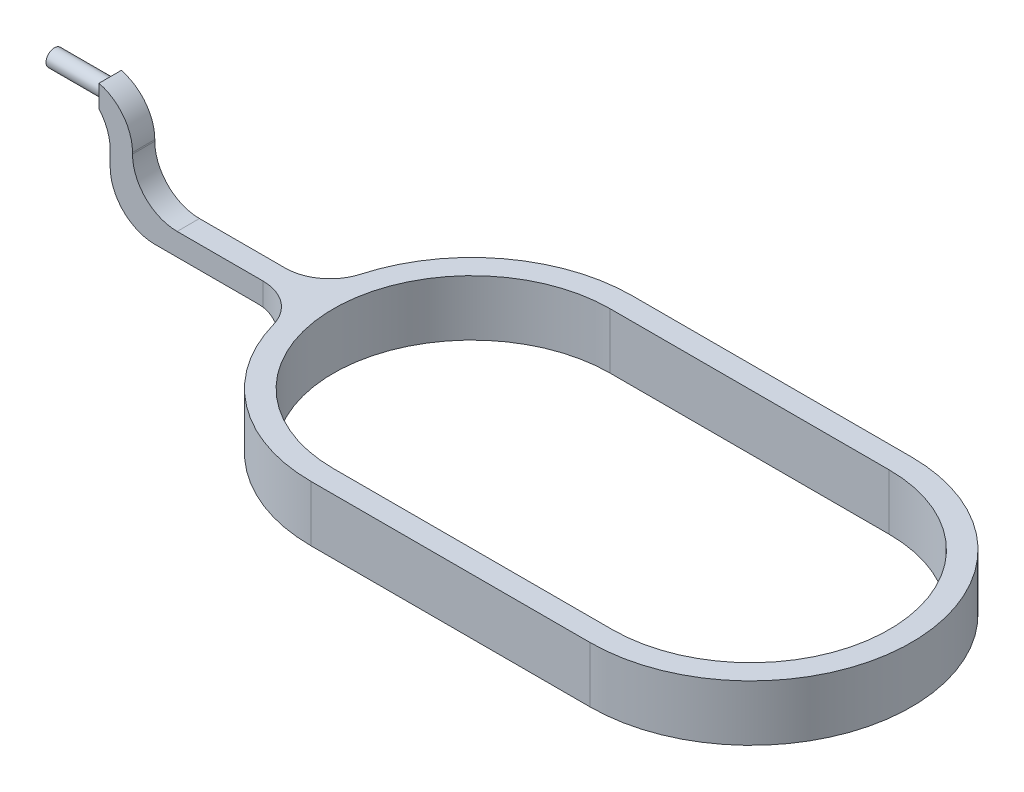
ISO-10303-21;
HEADER;
FILE_DESCRIPTION(('STEP AP214'),'2;1');
FILE_NAME('part.step','',(''),(''),'','','');
FILE_SCHEMA(('AUTOMOTIVE_DESIGN { 1 0 10303 214 1 1 1 1 }'));
ENDSEC;
DATA;
#1=APPLICATION_CONTEXT('core data for automotive mechanical design processes');
#2=APPLICATION_PROTOCOL_DEFINITION('international standard','automotive_design',2000,#1);
#3=PRODUCT_CONTEXT('',#1,'mechanical');
#4=PRODUCT('Part','Part','',(#3));
#5=PRODUCT_RELATED_PRODUCT_CATEGORY('part','',(#4));
#6=PRODUCT_DEFINITION_FORMATION('','',#4);
#7=PRODUCT_DEFINITION_CONTEXT('part definition',#1,'design');
#8=PRODUCT_DEFINITION('design','',#6,#7);
#9=PRODUCT_DEFINITION_SHAPE('','',#8);
#10=(LENGTH_UNIT() NAMED_UNIT(*) SI_UNIT(.MILLI.,.METRE.));
#11=(NAMED_UNIT(*) PLANE_ANGLE_UNIT() SI_UNIT($,.RADIAN.));
#12=(NAMED_UNIT(*) SI_UNIT($,.STERADIAN.) SOLID_ANGLE_UNIT());
#13=UNCERTAINTY_MEASURE_WITH_UNIT(LENGTH_MEASURE(1.E-05),#10,'distance_accuracy_value','');
#14=(GEOMETRIC_REPRESENTATION_CONTEXT(3) GLOBAL_UNCERTAINTY_ASSIGNED_CONTEXT((#13)) GLOBAL_UNIT_ASSIGNED_CONTEXT((#10,
#11,#12)) REPRESENTATION_CONTEXT('',''));
#15=CARTESIAN_POINT('',(0.,0.,0.));
#16=DIRECTION('',(0.,0.,1.));
#17=DIRECTION('',(1.,0.,0.));
#18=AXIS2_PLACEMENT_3D('',#15,#16,#17);
#19=CARTESIAN_POINT('',(0.,5.,0.));
#20=DIRECTION('',(0.,-1.,0.));
#21=DIRECTION('',(0.,0.,-1.));
#22=AXIS2_PLACEMENT_3D('',#19,#20,#21);
#23=CYLINDRICAL_SURFACE('',#22,14.4);
#24=CARTESIAN_POINT('',(0.,0.,0.));
#25=DIRECTION('',(0.,1.,0.));
#26=DIRECTION('',(0.,0.,1.));
#27=AXIS2_PLACEMENT_3D('',#24,#25,#26);
#28=CIRCLE('',#27,14.4);
#29=CARTESIAN_POINT('',(0.,0.,-14.4));
#30=VERTEX_POINT('',#29);
#31=CARTESIAN_POINT('',(-13.8581416769075,0.,-3.91304347826087));
#32=VERTEX_POINT('',#31);
#33=EDGE_CURVE('E293',#30,#32,#28,.T.);
#34=ORIENTED_EDGE('',*,*,#33,.T.);
#35=DIRECTION('',(0.,-1.,0.));
#36=VECTOR('',#35,1.);
#37=CARTESIAN_POINT('',(-13.8581416769075,5.,-3.91304347826087));
#38=LINE('',#37,#36);
#39=CARTESIAN_POINT('',(-13.8581416769075,5.,-3.91304347826087));
#40=VERTEX_POINT('',#39);
#41=EDGE_CURVE('E207',#32,#40,#38,.F.);
#42=ORIENTED_EDGE('',*,*,#41,.T.);
#43=CARTESIAN_POINT('',(0.,5.,0.));
#44=DIRECTION('',(0.,1.,0.));
#45=DIRECTION('',(0.,0.,1.));
#46=AXIS2_PLACEMENT_3D('',#43,#44,#45);
#47=CIRCLE('',#46,14.4);
#48=CARTESIAN_POINT('',(0.,5.,-14.4));
#49=VERTEX_POINT('',#48);
#50=EDGE_CURVE('E278',#49,#40,#47,.T.);
#51=ORIENTED_EDGE('',*,*,#50,.F.);
#52=DIRECTION('',(0.,-1.,0.));
#53=VECTOR('',#52,1.);
#54=CARTESIAN_POINT('',(0.,5.,-14.4));
#55=LINE('',#54,#53);
#56=EDGE_CURVE('E292',#49,#30,#55,.T.);
#57=ORIENTED_EDGE('',*,*,#56,.T.);
#58=EDGE_LOOP('',(#34,#42,#51,#57));
#59=FACE_BOUND('',#58,.T.);
#60=ADVANCED_FACE('F41',(#59),#23,.T.);
#61=CARTESIAN_POINT('',(-13.8581416769075,5.,3.91304347826087));
#62=VERTEX_POINT('',#61);
#63=CARTESIAN_POINT('',(0.,5.,14.4));
#64=VERTEX_POINT('',#63);
#65=EDGE_CURVE('E283',#62,#64,#47,.T.);
#66=ORIENTED_EDGE('',*,*,#65,.F.);
#67=DIRECTION('',(0.,-1.,0.));
#68=VECTOR('',#67,1.);
#69=CARTESIAN_POINT('',(-13.8581416769075,5.,3.91304347826087));
#70=LINE('',#69,#68);
#71=CARTESIAN_POINT('',(-13.8581416769075,0.,3.91304347826087));
#72=VERTEX_POINT('',#71);
#73=EDGE_CURVE('E330',#62,#72,#70,.T.);
#74=ORIENTED_EDGE('',*,*,#73,.T.);
#75=CARTESIAN_POINT('',(0.,0.,14.4));
#76=VERTEX_POINT('',#75);
#77=EDGE_CURVE('E277',#72,#76,#28,.T.);
#78=ORIENTED_EDGE('',*,*,#77,.T.);
#79=DIRECTION('',(0.,-1.,0.));
#80=VECTOR('',#79,1.);
#81=CARTESIAN_POINT('',(0.,5.,14.4));
#82=LINE('',#81,#80);
#83=EDGE_CURVE('E318',#64,#76,#82,.T.);
#84=ORIENTED_EDGE('',*,*,#83,.F.);
#85=EDGE_LOOP('',(#66,#74,#78,#84));
#86=FACE_BOUND('',#85,.T.);
#87=ADVANCED_FACE('F432',(#86),#23,.T.);
#88=CARTESIAN_POINT('',(0.,5.,0.));
#89=DIRECTION('',(0.,1.,0.));
#90=DIRECTION('',(0.,0.,1.));
#91=AXIS2_PLACEMENT_3D('',#88,#89,#90);
#92=PLANE('',#91);
#93=DIRECTION('',(1.,0.,0.));
#94=VECTOR('',#93,1.);
#95=CARTESIAN_POINT('',(0.,5.,12.4));
#96=LINE('',#95,#94);
#97=CARTESIAN_POINT('',(0.,5.,12.4));
#98=VERTEX_POINT('',#97);
#99=CARTESIAN_POINT('',(25.,5.,12.4));
#100=VERTEX_POINT('',#99);
#101=EDGE_CURVE('E238',#98,#100,#96,.T.);
#102=ORIENTED_EDGE('',*,*,#101,.F.);
#103=CARTESIAN_POINT('',(0.,5.,0.));
#104=DIRECTION('',(0.,1.,0.));
#105=DIRECTION('',(0.,0.,1.));
#106=AXIS2_PLACEMENT_3D('',#103,#104,#105);
#107=CIRCLE('',#106,12.4);
#108=CARTESIAN_POINT('',(0.,5.,-12.4));
#109=VERTEX_POINT('',#108);
#110=EDGE_CURVE('E235',#109,#98,#107,.T.);
#111=ORIENTED_EDGE('',*,*,#110,.F.);
#112=DIRECTION('',(-1.,0.,0.));
#113=VECTOR('',#112,1.);
#114=CARTESIAN_POINT('',(0.,5.,-12.4));
#115=LINE('',#114,#113);
#116=CARTESIAN_POINT('',(25.,5.,-12.4));
#117=VERTEX_POINT('',#116);
#118=EDGE_CURVE('E246',#117,#109,#115,.T.);
#119=ORIENTED_EDGE('',*,*,#118,.F.);
#120=CARTESIAN_POINT('',(25.,5.,0.));
#121=DIRECTION('',(0.,1.,0.));
#122=DIRECTION('',(0.,0.,1.));
#123=AXIS2_PLACEMENT_3D('',#120,#121,#122);
#124=CIRCLE('',#123,12.4);
#125=EDGE_CURVE('E242',#100,#117,#124,.T.);
#126=ORIENTED_EDGE('',*,*,#125,.F.);
#127=EDGE_LOOP('',(#102,#111,#119,#126));
#128=FACE_BOUND('',#127,.T.);
#129=DIRECTION('',(-1.,0.,0.));
#130=VECTOR('',#129,1.);
#131=CARTESIAN_POINT('',(0.,5.,-1.));
#132=LINE('',#131,#130);
#133=CARTESIAN_POINT('',(-17.7076254760484,5.,-1.));
#134=VERTEX_POINT('',#133);
#135=CARTESIAN_POINT('',(-25.4,5.,-1.));
#136=VERTEX_POINT('',#135);
#137=EDGE_CURVE('E232',#134,#136,#132,.T.);
#138=ORIENTED_EDGE('',*,*,#137,.T.);
#139=DIRECTION('',(0.,0.,1.));
#140=VECTOR('',#139,1.);
#141=CARTESIAN_POINT('',(-25.4,5.,0.));
#142=LINE('',#141,#140);
#143=CARTESIAN_POINT('',(-25.4,5.,1.));
#144=VERTEX_POINT('',#143);
#145=EDGE_CURVE('E352',#136,#144,#142,.T.);
#146=ORIENTED_EDGE('',*,*,#145,.T.);
#147=DIRECTION('',(-1.,0.,0.));
#148=VECTOR('',#147,1.);
#149=CARTESIAN_POINT('',(0.,5.,1.));
#150=LINE('',#149,#148);
#151=CARTESIAN_POINT('',(-17.7076254760484,5.,1.));
#152=VERTEX_POINT('',#151);
#153=EDGE_CURVE('E527',#152,#144,#150,.T.);
#154=ORIENTED_EDGE('',*,*,#153,.F.);
#155=CARTESIAN_POINT('',(-17.7076254760484,5.,5.));
#156=DIRECTION('',(0.,1.,0.));
#157=DIRECTION('',(0.,0.,1.));
#158=AXIS2_PLACEMENT_3D('',#155,#156,#157);
#159=CIRCLE('',#158,4.);
#160=EDGE_CURVE('E365',#152,#62,#159,.F.);
#161=ORIENTED_EDGE('',*,*,#160,.T.);
#162=ORIENTED_EDGE('',*,*,#65,.T.);
#163=DIRECTION('',(1.,0.,0.));
#164=VECTOR('',#163,1.);
#165=CARTESIAN_POINT('',(0.,5.,14.4));
#166=LINE('',#165,#164);
#167=CARTESIAN_POINT('',(25.,5.,14.4));
#168=VERTEX_POINT('',#167);
#169=EDGE_CURVE('E282',#64,#168,#166,.T.);
#170=ORIENTED_EDGE('',*,*,#169,.T.);
#171=CARTESIAN_POINT('',(25.,5.,0.));
#172=DIRECTION('',(0.,1.,0.));
#173=DIRECTION('',(0.,0.,1.));
#174=AXIS2_PLACEMENT_3D('',#171,#172,#173);
#175=CIRCLE('',#174,14.4);
#176=CARTESIAN_POINT('',(25.,5.,-14.4));
#177=VERTEX_POINT('',#176);
#178=EDGE_CURVE('E286',#168,#177,#175,.T.);
#179=ORIENTED_EDGE('',*,*,#178,.T.);
#180=DIRECTION('',(-1.,0.,0.));
#181=VECTOR('',#180,1.);
#182=CARTESIAN_POINT('',(0.,5.,-14.4));
#183=LINE('',#182,#181);
#184=EDGE_CURVE('E289',#177,#49,#183,.T.);
#185=ORIENTED_EDGE('',*,*,#184,.T.);
#186=ORIENTED_EDGE('',*,*,#50,.T.);
#187=CARTESIAN_POINT('',(-17.7076254760484,5.,-5.));
#188=DIRECTION('',(0.,1.,0.));
#189=DIRECTION('',(0.,0.,1.));
#190=AXIS2_PLACEMENT_3D('',#187,#188,#189);
#191=CIRCLE('',#190,4.);
#192=EDGE_CURVE('E362',#40,#134,#191,.F.);
#193=ORIENTED_EDGE('',*,*,#192,.T.);
#194=EDGE_LOOP('',(#138,#146,#154,#161,#162,#170,#179,#185,#186,#193));
#195=FACE_BOUND('',#194,.T.);
#196=ADVANCED_FACE('F428',(#128,#195),#92,.T.);
#197=CARTESIAN_POINT('',(0.,0.,0.));
#198=DIRECTION('',(0.,1.,0.));
#199=DIRECTION('',(0.,0.,1.));
#200=AXIS2_PLACEMENT_3D('',#197,#198,#199);
#201=PLANE('',#200);
#202=ORIENTED_EDGE('',*,*,#33,.F.);
#203=DIRECTION('',(-1.,0.,0.));
#204=VECTOR('',#203,1.);
#205=CARTESIAN_POINT('',(0.,0.,-14.4));
#206=LINE('',#205,#204);
#207=CARTESIAN_POINT('',(25.,0.,-14.4));
#208=VERTEX_POINT('',#207);
#209=EDGE_CURVE('E304',#208,#30,#206,.T.);
#210=ORIENTED_EDGE('',*,*,#209,.F.);
#211=CARTESIAN_POINT('',(25.,0.,0.));
#212=DIRECTION('',(0.,1.,0.));
#213=DIRECTION('',(0.,0.,1.));
#214=AXIS2_PLACEMENT_3D('',#211,#212,#213);
#215=CIRCLE('',#214,14.4);
#216=CARTESIAN_POINT('',(25.,0.,14.4));
#217=VERTEX_POINT('',#216);
#218=EDGE_CURVE('E301',#217,#208,#215,.T.);
#219=ORIENTED_EDGE('',*,*,#218,.F.);
#220=DIRECTION('',(1.,0.,0.));
#221=VECTOR('',#220,1.);
#222=CARTESIAN_POINT('',(0.,0.,14.4));
#223=LINE('',#222,#221);
#224=EDGE_CURVE('E297',#76,#217,#223,.T.);
#225=ORIENTED_EDGE('',*,*,#224,.F.);
#226=ORIENTED_EDGE('',*,*,#77,.F.);
#227=EDGE_CURVE('E298',#32,#72,#28,.T.);
#228=ORIENTED_EDGE('',*,*,#227,.F.);
#229=EDGE_LOOP('',(#202,#210,#219,#225,#226,#228));
#230=FACE_BOUND('',#229,.T.);
#231=CARTESIAN_POINT('',(0.,0.,0.));
#232=DIRECTION('',(0.,1.,0.));
#233=DIRECTION('',(0.,0.,1.));
#234=AXIS2_PLACEMENT_3D('',#231,#232,#233);
#235=CIRCLE('',#234,12.4);
#236=CARTESIAN_POINT('',(0.,0.,-12.4));
#237=VERTEX_POINT('',#236);
#238=CARTESIAN_POINT('',(0.,0.,12.4));
#239=VERTEX_POINT('',#238);
#240=EDGE_CURVE('E229',#237,#239,#235,.T.);
#241=ORIENTED_EDGE('',*,*,#240,.T.);
#242=DIRECTION('',(1.,0.,0.));
#243=VECTOR('',#242,1.);
#244=CARTESIAN_POINT('',(0.,0.,12.4));
#245=LINE('',#244,#243);
#246=CARTESIAN_POINT('',(25.,0.,12.4));
#247=VERTEX_POINT('',#246);
#248=EDGE_CURVE('E253',#239,#247,#245,.T.);
#249=ORIENTED_EDGE('',*,*,#248,.T.);
#250=CARTESIAN_POINT('',(25.,0.,0.));
#251=DIRECTION('',(0.,1.,0.));
#252=DIRECTION('',(0.,0.,1.));
#253=AXIS2_PLACEMENT_3D('',#250,#251,#252);
#254=CIRCLE('',#253,12.4);
#255=CARTESIAN_POINT('',(25.,0.,-12.4));
#256=VERTEX_POINT('',#255);
#257=EDGE_CURVE('E257',#247,#256,#254,.T.);
#258=ORIENTED_EDGE('',*,*,#257,.T.);
#259=DIRECTION('',(-1.,0.,0.));
#260=VECTOR('',#259,1.);
#261=CARTESIAN_POINT('',(0.,0.,-12.4));
#262=LINE('',#261,#260);
#263=EDGE_CURVE('E239',#256,#237,#262,.T.);
#264=ORIENTED_EDGE('',*,*,#263,.T.);
#265=EDGE_LOOP('',(#241,#249,#258,#264));
#266=FACE_BOUND('',#265,.T.);
#267=ADVANCED_FACE('F431',(#230,#266),#201,.F.);
#268=CARTESIAN_POINT('',(0.,5.,14.4));
#269=DIRECTION('',(0.,0.,-1.));
#270=DIRECTION('',(-1.,0.,0.));
#271=AXIS2_PLACEMENT_3D('',#268,#269,#270);
#272=PLANE('',#271);
#273=ORIENTED_EDGE('',*,*,#224,.T.);
#274=DIRECTION('',(0.,-1.,0.));
#275=VECTOR('',#274,1.);
#276=CARTESIAN_POINT('',(25.,5.,14.4));
#277=LINE('',#276,#275);
#278=EDGE_CURVE('E314',#168,#217,#277,.T.);
#279=ORIENTED_EDGE('',*,*,#278,.F.);
#280=ORIENTED_EDGE('',*,*,#169,.F.);
#281=ORIENTED_EDGE('',*,*,#83,.T.);
#282=EDGE_LOOP('',(#273,#279,#280,#281));
#283=FACE_BOUND('',#282,.T.);
#284=ADVANCED_FACE('F436',(#283),#272,.F.);
#285=CARTESIAN_POINT('',(25.,5.,0.));
#286=DIRECTION('',(0.,-1.,0.));
#287=DIRECTION('',(0.,0.,-1.));
#288=AXIS2_PLACEMENT_3D('',#285,#286,#287);
#289=CYLINDRICAL_SURFACE('',#288,14.4);
#290=ORIENTED_EDGE('',*,*,#218,.T.);
#291=DIRECTION('',(0.,-1.,0.));
#292=VECTOR('',#291,1.);
#293=CARTESIAN_POINT('',(25.,5.,-14.4));
#294=LINE('',#293,#292);
#295=EDGE_CURVE('E310',#177,#208,#294,.T.);
#296=ORIENTED_EDGE('',*,*,#295,.F.);
#297=ORIENTED_EDGE('',*,*,#178,.F.);
#298=ORIENTED_EDGE('',*,*,#278,.T.);
#299=EDGE_LOOP('',(#290,#296,#297,#298));
#300=FACE_BOUND('',#299,.T.);
#301=ADVANCED_FACE('F440',(#300),#289,.T.);
#302=CARTESIAN_POINT('',(0.,5.,-14.4));
#303=DIRECTION('',(0.,0.,1.));
#304=DIRECTION('',(1.,0.,0.));
#305=AXIS2_PLACEMENT_3D('',#302,#303,#304);
#306=PLANE('',#305);
#307=ORIENTED_EDGE('',*,*,#209,.T.);
#308=ORIENTED_EDGE('',*,*,#56,.F.);
#309=ORIENTED_EDGE('',*,*,#184,.F.);
#310=ORIENTED_EDGE('',*,*,#295,.T.);
#311=EDGE_LOOP('',(#307,#308,#309,#310));
#312=FACE_BOUND('',#311,.T.);
#313=ADVANCED_FACE('F426',(#312),#306,.F.);
#314=CARTESIAN_POINT('',(0.,5.,0.));
#315=DIRECTION('',(0.,-1.,0.));
#316=DIRECTION('',(0.,0.,-1.));
#317=AXIS2_PLACEMENT_3D('',#314,#315,#316);
#318=CYLINDRICAL_SURFACE('',#317,12.4);
#319=ORIENTED_EDGE('',*,*,#240,.F.);
#320=DIRECTION('',(0.,-1.,0.));
#321=VECTOR('',#320,1.);
#322=CARTESIAN_POINT('',(0.,5.,-12.4));
#323=LINE('',#322,#321);
#324=EDGE_CURVE('E249',#109,#237,#323,.T.);
#325=ORIENTED_EDGE('',*,*,#324,.F.);
#326=ORIENTED_EDGE('',*,*,#110,.T.);
#327=DIRECTION('',(0.,-1.,0.));
#328=VECTOR('',#327,1.);
#329=CARTESIAN_POINT('',(0.,5.,12.4));
#330=LINE('',#329,#328);
#331=EDGE_CURVE('E273',#98,#239,#330,.T.);
#332=ORIENTED_EDGE('',*,*,#331,.T.);
#333=EDGE_LOOP('',(#319,#325,#326,#332));
#334=FACE_BOUND('',#333,.T.);
#335=ADVANCED_FACE('F422',(#334),#318,.F.);
#336=CARTESIAN_POINT('',(0.,5.,12.4));
#337=DIRECTION('',(0.,0.,-1.));
#338=DIRECTION('',(-1.,0.,0.));
#339=AXIS2_PLACEMENT_3D('',#336,#337,#338);
#340=PLANE('',#339);
#341=ORIENTED_EDGE('',*,*,#248,.F.);
#342=ORIENTED_EDGE('',*,*,#331,.F.);
#343=ORIENTED_EDGE('',*,*,#101,.T.);
#344=DIRECTION('',(0.,-1.,0.));
#345=VECTOR('',#344,1.);
#346=CARTESIAN_POINT('',(25.,5.,12.4));
#347=LINE('',#346,#345);
#348=EDGE_CURVE('E270',#100,#247,#347,.T.);
#349=ORIENTED_EDGE('',*,*,#348,.T.);
#350=EDGE_LOOP('',(#341,#342,#343,#349));
#351=FACE_BOUND('',#350,.T.);
#352=ADVANCED_FACE('F418',(#351),#340,.T.);
#353=CARTESIAN_POINT('',(25.,5.,0.));
#354=DIRECTION('',(0.,-1.,0.));
#355=DIRECTION('',(0.,0.,-1.));
#356=AXIS2_PLACEMENT_3D('',#353,#354,#355);
#357=CYLINDRICAL_SURFACE('',#356,12.4);
#358=ORIENTED_EDGE('',*,*,#257,.F.);
#359=ORIENTED_EDGE('',*,*,#348,.F.);
#360=ORIENTED_EDGE('',*,*,#125,.T.);
#361=DIRECTION('',(0.,-1.,0.));
#362=VECTOR('',#361,1.);
#363=CARTESIAN_POINT('',(25.,5.,-12.4));
#364=LINE('',#363,#362);
#365=EDGE_CURVE('E267',#117,#256,#364,.T.);
#366=ORIENTED_EDGE('',*,*,#365,.T.);
#367=EDGE_LOOP('',(#358,#359,#360,#366));
#368=FACE_BOUND('',#367,.T.);
#369=ADVANCED_FACE('F414',(#368),#357,.F.);
#370=CARTESIAN_POINT('',(0.,5.,-12.4));
#371=DIRECTION('',(0.,0.,1.));
#372=DIRECTION('',(1.,0.,0.));
#373=AXIS2_PLACEMENT_3D('',#370,#371,#372);
#374=PLANE('',#373);
#375=ORIENTED_EDGE('',*,*,#263,.F.);
#376=ORIENTED_EDGE('',*,*,#365,.F.);
#377=ORIENTED_EDGE('',*,*,#118,.T.);
#378=ORIENTED_EDGE('',*,*,#324,.T.);
#379=EDGE_LOOP('',(#375,#376,#377,#378));
#380=FACE_BOUND('',#379,.T.);
#381=ADVANCED_FACE('F397',(#380),#374,.T.);
#382=CARTESIAN_POINT('',(0.,0.,-1.));
#383=DIRECTION('',(0.,0.,1.));
#384=DIRECTION('',(1.,0.,0.));
#385=AXIS2_PLACEMENT_3D('',#382,#383,#384);
#386=PLANE('',#385);
#387=ORIENTED_EDGE('',*,*,#137,.F.);
#388=DIRECTION('',(0.,1.,0.));
#389=VECTOR('',#388,1.);
#390=CARTESIAN_POINT('',(-17.7076254760484,3.,-1.));
#391=LINE('',#390,#389);
#392=CARTESIAN_POINT('',(-17.7076254760484,2.96377047829429,-1.));
#393=VERTEX_POINT('',#392);
#394=EDGE_CURVE('E73',#134,#393,#391,.F.);
#395=ORIENTED_EDGE('',*,*,#394,.T.);
#396=CARTESIAN_POINT('',(-17.7076254760484,2.96377047829429,-1.));
#397=CARTESIAN_POINT('',(-17.7968817290654,2.97583993976516,-1.));
#398=CARTESIAN_POINT('',(-17.886341065835,2.98489379730922,-1.));
#399=CARTESIAN_POINT('',(-18.0656659163424,2.99697030518098,-1.));
#400=CARTESIAN_POINT('',(-18.1555314301229,2.99999295487216,-1.));
#401=CARTESIAN_POINT('',(-18.2456000276991,3.00000000000002,-1.));
#402=B_SPLINE_CURVE_WITH_KNOTS('',3,(#396,#397,#398,#399,#400,#401),.UNSPECIFIED.,.F.,.F.,(4,2,
4),(0.,0.269748971166199,0.539497970800734),.UNSPECIFIED.);
#403=CARTESIAN_POINT('',(-18.2456000276991,3.,-1.));
#404=VERTEX_POINT('',#403);
#405=EDGE_CURVE('E376',#393,#404,#402,.T.);
#406=ORIENTED_EDGE('',*,*,#405,.T.);
#407=DIRECTION('',(-1.,0.,0.));
#408=VECTOR('',#407,1.);
#409=CARTESIAN_POINT('',(0.,3.00000000000001,-1.));
#410=LINE('',#409,#408);
#411=CARTESIAN_POINT('',(-27.4,3.,-1.));
#412=VERTEX_POINT('',#411);
#413=EDGE_CURVE('E525',#404,#412,#410,.T.);
#414=ORIENTED_EDGE('',*,*,#413,.T.);
#415=CARTESIAN_POINT('',(-27.4,7.,-1.));
#416=DIRECTION('',(0.,0.,1.));
#417=DIRECTION('',(1.,0.,0.));
#418=AXIS2_PLACEMENT_3D('',#415,#416,#417);
#419=CIRCLE('',#418,4.);
#420=CARTESIAN_POINT('',(-31.4,7.,-1.));
#421=VERTEX_POINT('',#420);
#422=EDGE_CURVE('E325',#412,#421,#419,.F.);
#423=ORIENTED_EDGE('',*,*,#422,.T.);
#424=DIRECTION('',(0.,1.,0.));
#425=VECTOR('',#424,1.);
#426=CARTESIAN_POINT('',(-31.4,0.,-1.));
#427=LINE('',#426,#425);
#428=CARTESIAN_POINT('',(-31.4,8.35424868893541,-1.));
#429=VERTEX_POINT('',#428);
#430=EDGE_CURVE('E520',#421,#429,#427,.T.);
#431=ORIENTED_EDGE('',*,*,#430,.T.);
#432=CARTESIAN_POINT('',(-35.4,8.35424868893541,-1.));
#433=DIRECTION('',(0.,0.,1.));
#434=DIRECTION('',(1.,0.,0.));
#435=AXIS2_PLACEMENT_3D('',#432,#433,#434);
#436=CIRCLE('',#435,4.);
#437=CARTESIAN_POINT('',(-32.4,11.,-1.));
#438=VERTEX_POINT('',#437);
#439=EDGE_CURVE('E11',#429,#438,#436,.T.);
#440=ORIENTED_EDGE('',*,*,#439,.T.);
#441=DIRECTION('',(0.,-1.,0.));
#442=VECTOR('',#441,1.);
#443=CARTESIAN_POINT('',(-32.4,0.,-1.));
#444=LINE('',#443,#442);
#445=CARTESIAN_POINT('',(-32.4,13.,-1.));
#446=VERTEX_POINT('',#445);
#447=EDGE_CURVE('E518',#446,#438,#444,.T.);
#448=ORIENTED_EDGE('',*,*,#447,.F.);
#449=CARTESIAN_POINT('',(-33.4,9.12701665379258,-1.));
#450=DIRECTION('',(0.,0.,1.));
#451=DIRECTION('',(1.,0.,0.));
#452=AXIS2_PLACEMENT_3D('',#449,#450,#451);
#453=CIRCLE('',#452,4.);
#454=CARTESIAN_POINT('',(-29.4,9.12701665379258,-1.));
#455=VERTEX_POINT('',#454);
#456=EDGE_CURVE('E223',#446,#455,#453,.F.);
#457=ORIENTED_EDGE('',*,*,#456,.T.);
#458=DIRECTION('',(0.,-1.,0.));
#459=VECTOR('',#458,1.);
#460=CARTESIAN_POINT('',(-29.4,0.,-1.));
#461=LINE('',#460,#459);
#462=CARTESIAN_POINT('',(-29.4,9.,-1.));
#463=VERTEX_POINT('',#462);
#464=EDGE_CURVE('E225',#455,#463,#461,.T.);
#465=ORIENTED_EDGE('',*,*,#464,.T.);
#466=CARTESIAN_POINT('',(-25.4,9.,-1.));
#467=DIRECTION('',(0.,0.,1.));
#468=DIRECTION('',(1.,0.,0.));
#469=AXIS2_PLACEMENT_3D('',#466,#467,#468);
#470=CIRCLE('',#469,4.);
#471=EDGE_CURVE('E540',#463,#136,#470,.T.);
#472=ORIENTED_EDGE('',*,*,#471,.T.);
#473=EDGE_LOOP('',(#387,#395,#406,#414,#423,#431,#440,#448,#457,#465,#472));
#474=FACE_BOUND('',#473,.T.);
#475=ADVANCED_FACE('F391',(#474),#386,.F.);
#476=CARTESIAN_POINT('',(0.,0.,1.));
#477=DIRECTION('',(0.,0.,1.));
#478=DIRECTION('',(1.,0.,0.));
#479=AXIS2_PLACEMENT_3D('',#476,#477,#478);
#480=PLANE('',#479);
#481=DIRECTION('',(-1.,0.,0.));
#482=VECTOR('',#481,1.);
#483=CARTESIAN_POINT('',(0.,3.00000000000001,1.));
#484=LINE('',#483,#482);
#485=CARTESIAN_POINT('',(-18.2456000276991,3.,1.));
#486=VERTEX_POINT('',#485);
#487=CARTESIAN_POINT('',(-27.4,3.,1.));
#488=VERTEX_POINT('',#487);
#489=EDGE_CURVE('E551',#486,#488,#484,.T.);
#490=ORIENTED_EDGE('',*,*,#489,.F.);
#491=CARTESIAN_POINT('',(-18.2456000276991,3.,1.));
#492=CARTESIAN_POINT('',(-18.1555314301229,2.99999295487215,1.));
#493=CARTESIAN_POINT('',(-18.0656659163424,2.99697030518098,1.));
#494=CARTESIAN_POINT('',(-17.886341065835,2.98489379730923,1.));
#495=CARTESIAN_POINT('',(-17.7968817290654,2.97583993976516,1.));
#496=CARTESIAN_POINT('',(-17.7076254760484,2.96377047829429,1.));
#497=B_SPLINE_CURVE_WITH_KNOTS('',3,(#491,#492,#493,#494,#495,#496),.UNSPECIFIED.,.F.,.F.,(4,2,
4),(0.,0.269748999634538,0.539497970800737),.UNSPECIFIED.);
#498=CARTESIAN_POINT('',(-17.7076254760484,2.96377047829429,1.));
#499=VERTEX_POINT('',#498);
#500=EDGE_CURVE('E368',#486,#499,#497,.T.);
#501=ORIENTED_EDGE('',*,*,#500,.T.);
#502=DIRECTION('',(0.,-1.,0.));
#503=VECTOR('',#502,1.);
#504=CARTESIAN_POINT('',(-17.7076254760484,0.,1.));
#505=LINE('',#504,#503);
#506=EDGE_CURVE('E65',#499,#152,#505,.F.);
#507=ORIENTED_EDGE('',*,*,#506,.T.);
#508=ORIENTED_EDGE('',*,*,#153,.T.);
#509=CARTESIAN_POINT('',(-25.4,9.,1.));
#510=DIRECTION('',(0.,0.,1.));
#511=DIRECTION('',(1.,0.,0.));
#512=AXIS2_PLACEMENT_3D('',#509,#510,#511);
#513=CIRCLE('',#512,4.);
#514=CARTESIAN_POINT('',(-29.4,9.,1.));
#515=VERTEX_POINT('',#514);
#516=EDGE_CURVE('E541',#144,#515,#513,.F.);
#517=ORIENTED_EDGE('',*,*,#516,.T.);
#518=DIRECTION('',(0.,-1.,0.));
#519=VECTOR('',#518,1.);
#520=CARTESIAN_POINT('',(-29.4,0.,1.));
#521=LINE('',#520,#519);
#522=CARTESIAN_POINT('',(-29.4,9.12701665379258,1.));
#523=VERTEX_POINT('',#522);
#524=EDGE_CURVE('E200',#523,#515,#521,.T.);
#525=ORIENTED_EDGE('',*,*,#524,.F.);
#526=CARTESIAN_POINT('',(-33.4,9.12701665379258,1.));
#527=DIRECTION('',(0.,0.,1.));
#528=DIRECTION('',(1.,0.,0.));
#529=AXIS2_PLACEMENT_3D('',#526,#527,#528);
#530=CIRCLE('',#529,4.);
#531=CARTESIAN_POINT('',(-32.4,13.,1.));
#532=VERTEX_POINT('',#531);
#533=EDGE_CURVE('E194',#523,#532,#530,.T.);
#534=ORIENTED_EDGE('',*,*,#533,.T.);
#535=DIRECTION('',(0.,-1.,0.));
#536=VECTOR('',#535,1.);
#537=CARTESIAN_POINT('',(-32.4,0.,1.));
#538=LINE('',#537,#536);
#539=CARTESIAN_POINT('',(-32.4,11.,1.));
#540=VERTEX_POINT('',#539);
#541=EDGE_CURVE('E198',#532,#540,#538,.T.);
#542=ORIENTED_EDGE('',*,*,#541,.T.);
#543=CARTESIAN_POINT('',(-35.4,8.35424868893541,1.));
#544=DIRECTION('',(0.,0.,1.));
#545=DIRECTION('',(1.,0.,0.));
#546=AXIS2_PLACEMENT_3D('',#543,#544,#545);
#547=CIRCLE('',#546,4.);
#548=CARTESIAN_POINT('',(-31.4,8.35424868893541,1.));
#549=VERTEX_POINT('',#548);
#550=EDGE_CURVE('E57',#540,#549,#547,.F.);
#551=ORIENTED_EDGE('',*,*,#550,.T.);
#552=DIRECTION('',(0.,1.,0.));
#553=VECTOR('',#552,1.);
#554=CARTESIAN_POINT('',(-31.4,0.,1.));
#555=LINE('',#554,#553);
#556=CARTESIAN_POINT('',(-31.4,7.,1.));
#557=VERTEX_POINT('',#556);
#558=EDGE_CURVE('E218',#557,#549,#555,.T.);
#559=ORIENTED_EDGE('',*,*,#558,.F.);
#560=CARTESIAN_POINT('',(-27.4,7.,1.));
#561=DIRECTION('',(0.,0.,1.));
#562=DIRECTION('',(1.,0.,0.));
#563=AXIS2_PLACEMENT_3D('',#560,#561,#562);
#564=CIRCLE('',#563,4.);
#565=EDGE_CURVE('E206',#557,#488,#564,.T.);
#566=ORIENTED_EDGE('',*,*,#565,.T.);
#567=EDGE_LOOP('',(#490,#501,#507,#508,#517,#525,#534,#542,#551,#559,#566));
#568=FACE_BOUND('',#567,.T.);
#569=ADVANCED_FACE('F197',(#568),#480,.T.);
#570=CARTESIAN_POINT('',(-29.4,0.,-1.));
#571=DIRECTION('',(-1.,0.,0.));
#572=DIRECTION('',(0.,0.,1.));
#573=AXIS2_PLACEMENT_3D('',#570,#571,#572);
#574=PLANE('',#573);
#575=ORIENTED_EDGE('',*,*,#524,.T.);
#576=DIRECTION('',(0.,0.,1.));
#577=VECTOR('',#576,1.);
#578=CARTESIAN_POINT('',(-29.4,9.,-1.));
#579=LINE('',#578,#577);
#580=EDGE_CURVE('E359',#515,#463,#579,.F.);
#581=ORIENTED_EDGE('',*,*,#580,.T.);
#582=ORIENTED_EDGE('',*,*,#464,.F.);
#583=DIRECTION('',(0.,0.,1.));
#584=VECTOR('',#583,1.);
#585=CARTESIAN_POINT('',(-29.4,9.12701665379258,-1.));
#586=LINE('',#585,#584);
#587=EDGE_CURVE('E356',#455,#523,#586,.T.);
#588=ORIENTED_EDGE('',*,*,#587,.T.);
#589=EDGE_LOOP('',(#575,#581,#582,#588));
#590=FACE_BOUND('',#589,.T.);
#591=ADVANCED_FACE('F390',(#590),#574,.F.);
#592=CARTESIAN_POINT('',(0.,3.00000000000001,-1.));
#593=DIRECTION('',(0.,1.,0.));
#594=DIRECTION('',(-1.,0.,0.));
#595=AXIS2_PLACEMENT_3D('',#592,#593,#594);
#596=PLANE('',#595);
#597=ORIENTED_EDGE('',*,*,#413,.F.);
#598=CARTESIAN_POINT('',(0.,3.00000000000001,0.));
#599=DIRECTION('',(0.,1.,0.));
#600=DIRECTION('',(-1.,0.,0.));
#601=AXIS2_PLACEMENT_3D('',#598,#599,#600);
#602=CIRCLE('',#601,18.2729833462074);
#603=EDGE_CURVE('E342',#404,#486,#602,.T.);
#604=ORIENTED_EDGE('',*,*,#603,.T.);
#605=ORIENTED_EDGE('',*,*,#489,.T.);
#606=DIRECTION('',(0.,0.,1.));
#607=VECTOR('',#606,1.);
#608=CARTESIAN_POINT('',(-27.4,3.,-1.));
#609=LINE('',#608,#607);
#610=EDGE_CURVE('E339',#488,#412,#609,.F.);
#611=ORIENTED_EDGE('',*,*,#610,.T.);
#612=EDGE_LOOP('',(#597,#604,#605,#611));
#613=FACE_BOUND('',#612,.T.);
#614=ADVANCED_FACE('F400',(#613),#596,.F.);
#615=CARTESIAN_POINT('',(-31.4,0.,-1.));
#616=DIRECTION('',(1.,0.,0.));
#617=DIRECTION('',(0.,0.,-1.));
#618=AXIS2_PLACEMENT_3D('',#615,#616,#617);
#619=PLANE('',#618);
#620=ORIENTED_EDGE('',*,*,#430,.F.);
#621=DIRECTION('',(0.,0.,1.));
#622=VECTOR('',#621,1.);
#623=CARTESIAN_POINT('',(-31.4,7.,-1.));
#624=LINE('',#623,#622);
#625=EDGE_CURVE('E348',#421,#557,#624,.T.);
#626=ORIENTED_EDGE('',*,*,#625,.T.);
#627=ORIENTED_EDGE('',*,*,#558,.T.);
#628=DIRECTION('',(0.,0.,1.));
#629=VECTOR('',#628,1.);
#630=CARTESIAN_POINT('',(-31.4,8.35424868893541,-1.));
#631=LINE('',#630,#629);
#632=EDGE_CURVE('E345',#549,#429,#631,.F.);
#633=ORIENTED_EDGE('',*,*,#632,.T.);
#634=EDGE_LOOP('',(#620,#626,#627,#633));
#635=FACE_BOUND('',#634,.T.);
#636=ADVANCED_FACE('F404',(#635),#619,.F.);
#637=CARTESIAN_POINT('',(-32.4,0.,-1.));
#638=DIRECTION('',(-1.,0.,0.));
#639=DIRECTION('',(0.,0.,1.));
#640=AXIS2_PLACEMENT_3D('',#637,#638,#639);
#641=PLANE('',#640);
#642=CARTESIAN_POINT('',(-32.4,12.,0.));
#643=DIRECTION('',(-1.,0.,0.));
#644=DIRECTION('',(0.,0.,1.));
#645=AXIS2_PLACEMENT_3D('',#642,#643,#644);
#646=CIRCLE('',#645,0.75);
#647=CARTESIAN_POINT('',(-32.4,12.,0.75));
#648=VERTEX_POINT('',#647);
#649=EDGE_CURVE('E322',#648,#648,#646,.T.);
#650=ORIENTED_EDGE('',*,*,#649,.F.);
#651=EDGE_LOOP('',(#650));
#652=FACE_BOUND('',#651,.T.);
#653=DIRECTION('',(0.,0.,1.));
#654=VECTOR('',#653,1.);
#655=CARTESIAN_POINT('',(-32.4,11.,-1.));
#656=LINE('',#655,#654);
#657=EDGE_CURVE('E216',#438,#540,#656,.T.);
#658=ORIENTED_EDGE('',*,*,#657,.T.);
#659=ORIENTED_EDGE('',*,*,#541,.F.);
#660=DIRECTION('',(0.,0.,1.));
#661=VECTOR('',#660,1.);
#662=CARTESIAN_POINT('',(-32.4,13.,-1.));
#663=LINE('',#662,#661);
#664=EDGE_CURVE('E213',#446,#532,#663,.T.);
#665=ORIENTED_EDGE('',*,*,#664,.F.);
#666=ORIENTED_EDGE('',*,*,#447,.T.);
#667=EDGE_LOOP('',(#658,#659,#665,#666));
#668=FACE_BOUND('',#667,.T.);
#669=ADVANCED_FACE('F211',(#652,#668),#641,.T.);
#670=CARTESIAN_POINT('',(-37.4,12.,0.));
#671=DIRECTION('',(1.,0.,0.));
#672=DIRECTION('',(0.,0.,-1.));
#673=AXIS2_PLACEMENT_3D('',#670,#671,#672);
#674=CYLINDRICAL_SURFACE('',#673,0.75);
#675=CARTESIAN_POINT('',(-37.4,12.,0.));
#676=DIRECTION('',(-1.,0.,0.));
#677=DIRECTION('',(0.,0.,1.));
#678=AXIS2_PLACEMENT_3D('',#675,#676,#677);
#679=CIRCLE('',#678,0.75);
#680=CARTESIAN_POINT('',(-37.4,12.,0.75));
#681=VERTEX_POINT('',#680);
#682=EDGE_CURVE('E219',#681,#681,#679,.T.);
#683=ORIENTED_EDGE('',*,*,#682,.F.);
#684=EDGE_LOOP('',(#683));
#685=FACE_BOUND('',#684,.T.);
#686=ORIENTED_EDGE('',*,*,#649,.T.);
#687=EDGE_LOOP('',(#686));
#688=FACE_BOUND('',#687,.T.);
#689=ADVANCED_FACE('F392',(#685,#688),#674,.T.);
#690=CARTESIAN_POINT('',(-37.4,12.,0.));
#691=DIRECTION('',(-1.,0.,0.));
#692=DIRECTION('',(0.,0.,1.));
#693=AXIS2_PLACEMENT_3D('',#690,#691,#692);
#694=PLANE('',#693);
#695=ORIENTED_EDGE('',*,*,#682,.T.);
#696=EDGE_LOOP('',(#695));
#697=FACE_BOUND('',#696,.T.);
#698=ADVANCED_FACE('F501',(#697),#694,.T.);
#699=CARTESIAN_POINT('',(-17.7076254760484,5.,5.));
#700=DIRECTION('',(0.,-1.,0.));
#701=DIRECTION('',(0.,0.,-1.));
#702=AXIS2_PLACEMENT_3D('',#699,#700,#701);
#703=CYLINDRICAL_SURFACE('',#702,4.);
#704=ORIENTED_EDGE('',*,*,#506,.F.);
#705=CARTESIAN_POINT('',(-13.8581416769075,0.,3.91304347826087));
#706=CARTESIAN_POINT('',(-13.8737938876321,-0.000294259518479108,3.85749041928666));
#707=CARTESIAN_POINT('',(-13.8905485156222,0.00618796660121231,3.80285822462944));
#708=CARTESIAN_POINT('',(-13.9252196071237,0.0293310111936594,3.69756857155878));
#709=CARTESIAN_POINT('',(-13.9430994817074,0.0457488752218204,3.64684785363683));
#710=CARTESIAN_POINT('',(-13.9914064076107,0.0983293148209997,3.51772731990999));
#711=CARTESIAN_POINT('',(-14.022597364865,0.140410343611279,3.44218121836609));
#712=CARTESIAN_POINT('',(-14.0873412640276,0.234183954904848,3.29708069975151));
#713=CARTESIAN_POINT('',(-14.1209231291292,0.286014254441508,3.22763615023574));
#714=CARTESIAN_POINT('',(-14.1872189518468,0.38953078163517,3.09961944736791));
#715=CARTESIAN_POINT('',(-14.2197470587856,0.440824454146512,3.04062889337523));
#716=CARTESIAN_POINT('',(-14.2868302646084,0.545519182918933,2.92573395317281));
#717=CARTESIAN_POINT('',(-14.3213863074125,0.598921216689077,2.86983102800537));
#718=CARTESIAN_POINT('',(-14.4284640442125,0.760825600972446,2.70560391194934));
#719=CARTESIAN_POINT('',(-14.5043012374718,0.870870047216904,2.60094072082962));
#720=CARTESIAN_POINT('',(-14.6656328024986,1.0901822700339,2.39945757162488));
#721=CARTESIAN_POINT('',(-14.7510957466308,1.19945140322819,2.30261376520745));
#722=CARTESIAN_POINT('',(-14.9327239069249,1.41497459274689,2.11610544209172));
#723=CARTESIAN_POINT('',(-15.028877155929,1.52123185667972,2.02643308699727));
#724=CARTESIAN_POINT('',(-15.2051398481631,1.7005427458096,1.87798369542267));
#725=CARTESIAN_POINT('',(-15.2825309220136,1.77478777284131,1.81742193837484));
#726=CARTESIAN_POINT('',(-15.4437431771096,1.91974104200883,1.70079620169589));
#727=CARTESIAN_POINT('',(-15.5275654907623,1.9904486576425,1.64473301774152));
#728=CARTESIAN_POINT('',(-15.7888545414628,2.19574565234211,1.48431622608212));
#729=CARTESIAN_POINT('',(-15.9764635190279,2.32384491868427,1.38745891214722));
#730=CARTESIAN_POINT('',(-16.3270922758164,2.52454813536204,1.24229892027353));
#731=CARTESIAN_POINT('',(-16.4842132088756,2.60297789363872,1.18791261636446));
#732=CARTESIAN_POINT('',(-16.7294295472945,2.70665371122244,1.12052630620109));
#733=CARTESIAN_POINT('',(-16.8126866193091,2.73886385096737,1.10044020443041));
#734=CARTESIAN_POINT('',(-16.982030251886,2.79819901971185,1.06541215230009));
#735=CARTESIAN_POINT('',(-17.0681156451406,2.82532611635832,1.05046810821012));
#736=CARTESIAN_POINT('',(-17.245362454345,2.87482131038946,1.02576363679064));
#737=CARTESIAN_POINT('',(-17.3365983727148,2.89701307451913,1.01618085556));
#738=CARTESIAN_POINT('',(-17.5209340609593,2.93517373917617,1.00328343288944));
#739=CARTESIAN_POINT('',(-17.6140363905249,2.9511333771772,0.999978093371042));
#740=CARTESIAN_POINT('',(-17.7076254760485,2.96377047829427,1.));
#741=B_SPLINE_CURVE_WITH_KNOTS('',3,(#705,#706,#707,#708,#709,#710,#711,#712,#713,#714,#715,
#716,#717,#718,#719,#720,#721,#722,#723,#724,#725,#726,#727,#728,#729,#730,#731,#732,#733,#734,
#735,#736,#737,#738,#739,#740),.UNSPECIFIED.,.F.,.F.,(4,2,2,2,2,2,2,2,2,2,2,2,2,2,2,2,2,4),(0.,
0.17185224294385,0.339663044924739,0.613933492801665,0.892417121451952,1.1462747674648,
1.40025152556136,1.90896987853631,2.4160729701018,2.92261399959858,3.29181713377696,
3.66108542678678,4.39801662296586,4.94734358143704,5.22156581429315,5.49567625752072,
5.77840031883562,6.06154299516293),.UNSPECIFIED.);
#742=EDGE_CURVE('E45',#72,#499,#741,.T.);
#743=ORIENTED_EDGE('',*,*,#742,.F.);
#744=ORIENTED_EDGE('',*,*,#73,.F.);
#745=ORIENTED_EDGE('',*,*,#160,.F.);
#746=EDGE_LOOP('',(#704,#743,#744,#745));
#747=FACE_BOUND('',#746,.T.);
#748=ADVANCED_FACE('F461',(#747),#703,.F.);
#749=CARTESIAN_POINT('',(0.,-0.999999999999989,0.));
#750=DIRECTION('',(0.,1.,0.));
#751=DIRECTION('',(-1.,0.,0.));
#752=AXIS2_PLACEMENT_3D('',#749,#750,#751);
#753=TOROIDAL_SURFACE('',#752,18.2729833462074,4.);
#754=ORIENTED_EDGE('',*,*,#603,.F.);
#755=ORIENTED_EDGE('',*,*,#405,.F.);
#756=CARTESIAN_POINT('',(-17.7076254760484,2.96377047829429,-1.));
#757=CARTESIAN_POINT('',(-17.6117296301297,2.95082340756574,-0.99997627431075));
#758=CARTESIAN_POINT('',(-17.5163486952263,2.93438679264278,-1.00344726984538));
#759=CARTESIAN_POINT('',(-17.3275515447703,2.89496710276313,-1.01698140578546));
#760=CARTESIAN_POINT('',(-17.2341328840489,2.87199276679836,-1.02703576936773));
#761=CARTESIAN_POINT('',(-17.0509554820436,2.82018207724713,-1.05319572042867));
#762=CARTESIAN_POINT('',(-16.9611676692103,2.79141344848393,-1.06923307210432));
#763=CARTESIAN_POINT('',(-16.7847451299373,2.72838037431,-1.1068733871861));
#764=CARTESIAN_POINT('',(-16.698111339913,2.69411431280099,-1.12847798835041));
#765=CARTESIAN_POINT('',(-16.444574519127,2.58429453092733,-1.2006024377427));
#766=CARTESIAN_POINT('',(-16.2829040940831,2.50138895023771,-1.25860565628762));
#767=CARTESIAN_POINT('',(-15.9751066097444,2.32012854206688,-1.3907593364351));
#768=CARTESIAN_POINT('',(-15.8290378392388,2.22171896073732,-1.46496739987747));
#769=CARTESIAN_POINT('',(-15.5793623262941,2.03347731749449,-1.61072174313202));
#770=CARTESIAN_POINT('',(-15.4729698838029,1.9455878969947,-1.68007732498755));
#771=CARTESIAN_POINT('',(-15.2703010505574,1.7641885464265,-1.82587904099592));
#772=CARTESIAN_POINT('',(-15.1740275327962,1.67067703190077,-1.90232717734965));
#773=CARTESIAN_POINT('',(-14.9910830845503,1.47972877771796,-2.06144664523111));
#774=CARTESIAN_POINT('',(-14.9044111547497,1.38229244799066,-2.14411732762054));
#775=CARTESIAN_POINT('',(-14.7400352695933,1.18516460110039,-2.31532176916675));
#776=CARTESIAN_POINT('',(-14.6623275930191,1.08547404041234,-2.40385307128266));
#777=CARTESIAN_POINT('',(-14.5218583744074,0.894921412183984,-2.57878260280288));
#778=CARTESIAN_POINT('',(-14.4583798919814,0.804085619965899,-2.66463562697648));
#779=CARTESIAN_POINT('',(-14.337519348466,0.624302827964143,-2.84268332193074));
#780=CARTESIAN_POINT('',(-14.2801445185591,0.535358166273757,-2.93488530619558));
#781=CARTESIAN_POINT('',(-14.1821921619763,0.381828604454725,-3.10815733204024));
#782=CARTESIAN_POINT('',(-14.1406078798826,0.316033585172747,-3.18753529550533));
#783=CARTESIAN_POINT('',(-14.0805076300217,0.224663791079877,-3.31294883832557));
#784=CARTESIAN_POINT('',(-14.060873405503,0.19545504799283,-3.35576184394543));
#785=CARTESIAN_POINT('',(-14.022345185557,0.140846904143041,-3.44403480852449));
#786=CARTESIAN_POINT('',(-14.0034502244074,0.115442402078232,-3.48949110724003));
#787=CARTESIAN_POINT('',(-13.9669497748767,0.0709938713836277,-3.58233610496081));
#788=CARTESIAN_POINT('',(-13.9493234279924,0.0517998816197516,-3.62964232252877));
#789=CARTESIAN_POINT('',(-13.915223105282,0.0216678897591637,-3.72709014949311));
#790=CARTESIAN_POINT('',(-13.8987436132783,0.0106874716708966,-3.77721573409713));
#791=CARTESIAN_POINT('',(-13.8745180007743,0.00160212458886763,-3.85624253140448));
#792=CARTESIAN_POINT('',(-13.8661698263266,-6.87135906586703E-05,-3.88458009388328));
#793=CARTESIAN_POINT('',(-13.8581416769075,0.,-3.91304347826087));
#794=B_SPLINE_CURVE_WITH_KNOTS('',3,(#756,#757,#758,#759,#760,#761,#762,#763,#764,#765,#766,
#767,#768,#769,#770,#771,#772,#773,#774,#775,#776,#777,#778,#779,#780,#781,#782,#783,#784,#785,
#786,#787,#788,#789,#790,#791,#792,#793),.UNSPECIFIED.,.F.,.F.,(4,2,2,2,2,2,2,2,2,2,2,2,2,2,2,2,
2,2,4),(0.,0.290107228738074,0.579828477280837,0.86634174301949,1.15293939085673,
1.72260584261212,2.29433118784094,2.75703713247154,3.21987409698218,3.68266284491007,
4.14525878450248,4.56555432745037,4.98634238837386,5.31932131164745,5.48545501930339,
5.6513639154661,5.81290106013091,5.97359813422361,6.06222320085945),.UNSPECIFIED.);
#795=EDGE_CURVE('E467',#32,#393,#794,.F.);
#796=ORIENTED_EDGE('',*,*,#795,.F.);
#797=ORIENTED_EDGE('',*,*,#227,.T.);
#798=ORIENTED_EDGE('',*,*,#742,.T.);
#799=ORIENTED_EDGE('',*,*,#500,.F.);
#800=EDGE_LOOP('',(#754,#755,#796,#797,#798,#799));
#801=FACE_BOUND('',#800,.T.);
#802=ADVANCED_FACE('F383',(#801),#753,.F.);
#803=CARTESIAN_POINT('',(-17.7076254760484,5.,-5.));
#804=DIRECTION('',(0.,-1.,0.));
#805=DIRECTION('',(0.,0.,-1.));
#806=AXIS2_PLACEMENT_3D('',#803,#804,#805);
#807=CYLINDRICAL_SURFACE('',#806,4.);
#808=ORIENTED_EDGE('',*,*,#192,.F.);
#809=ORIENTED_EDGE('',*,*,#41,.F.);
#810=ORIENTED_EDGE('',*,*,#795,.T.);
#811=ORIENTED_EDGE('',*,*,#394,.F.);
#812=EDGE_LOOP('',(#808,#809,#810,#811));
#813=FACE_BOUND('',#812,.T.);
#814=ADVANCED_FACE('F488',(#813),#807,.F.);
#815=CARTESIAN_POINT('',(-27.4,7.,-1.));
#816=DIRECTION('',(0.,0.,1.));
#817=DIRECTION('',(1.,0.,0.));
#818=AXIS2_PLACEMENT_3D('',#815,#816,#817);
#819=CYLINDRICAL_SURFACE('',#818,4.);
#820=ORIENTED_EDGE('',*,*,#422,.F.);
#821=ORIENTED_EDGE('',*,*,#610,.F.);
#822=ORIENTED_EDGE('',*,*,#565,.F.);
#823=ORIENTED_EDGE('',*,*,#625,.F.);
#824=EDGE_LOOP('',(#820,#821,#822,#823));
#825=FACE_BOUND('',#824,.T.);
#826=ADVANCED_FACE('F497',(#825),#819,.T.);
#827=CARTESIAN_POINT('',(-25.4,9.,0.));
#828=DIRECTION('',(0.,0.,1.));
#829=DIRECTION('',(1.,0.,0.));
#830=AXIS2_PLACEMENT_3D('',#827,#828,#829);
#831=CYLINDRICAL_SURFACE('',#830,4.);
#832=ORIENTED_EDGE('',*,*,#471,.F.);
#833=ORIENTED_EDGE('',*,*,#580,.F.);
#834=ORIENTED_EDGE('',*,*,#516,.F.);
#835=ORIENTED_EDGE('',*,*,#145,.F.);
#836=EDGE_LOOP('',(#832,#833,#834,#835));
#837=FACE_BOUND('',#836,.T.);
#838=ADVANCED_FACE('F504',(#837),#831,.F.);
#839=CARTESIAN_POINT('',(-33.4,9.12701665379258,-1.));
#840=DIRECTION('',(0.,0.,1.));
#841=DIRECTION('',(1.,0.,0.));
#842=AXIS2_PLACEMENT_3D('',#839,#840,#841);
#843=CYLINDRICAL_SURFACE('',#842,4.);
#844=ORIENTED_EDGE('',*,*,#456,.F.);
#845=ORIENTED_EDGE('',*,*,#664,.T.);
#846=ORIENTED_EDGE('',*,*,#533,.F.);
#847=ORIENTED_EDGE('',*,*,#587,.F.);
#848=EDGE_LOOP('',(#844,#845,#846,#847));
#849=FACE_BOUND('',#848,.T.);
#850=ADVANCED_FACE('F222',(#849),#843,.T.);
#851=CARTESIAN_POINT('',(-35.4,8.35424868893541,-1.));
#852=DIRECTION('',(0.,0.,1.));
#853=DIRECTION('',(1.,0.,0.));
#854=AXIS2_PLACEMENT_3D('',#851,#852,#853);
#855=CYLINDRICAL_SURFACE('',#854,4.);
#856=ORIENTED_EDGE('',*,*,#439,.F.);
#857=ORIENTED_EDGE('',*,*,#632,.F.);
#858=ORIENTED_EDGE('',*,*,#550,.F.);
#859=ORIENTED_EDGE('',*,*,#657,.F.);
#860=EDGE_LOOP('',(#856,#857,#858,#859));
#861=FACE_BOUND('',#860,.T.);
#862=ADVANCED_FACE('F43',(#861),#855,.F.);
#863=CLOSED_SHELL('',(#60,#87,#196,#267,#284,#301,#313,#335,#352,#369,#381,#475,#569,#591,#614,
#636,#669,#689,#698,#748,#802,#814,#826,#838,#850,#862));
#864=MANIFOLD_SOLID_BREP('B2',#863);
#865=ADVANCED_BREP_SHAPE_REPRESENTATION('',(#18,#864),#14);
#866=SHAPE_DEFINITION_REPRESENTATION(#9,#865);
ENDSEC;
END-ISO-10303-21;
